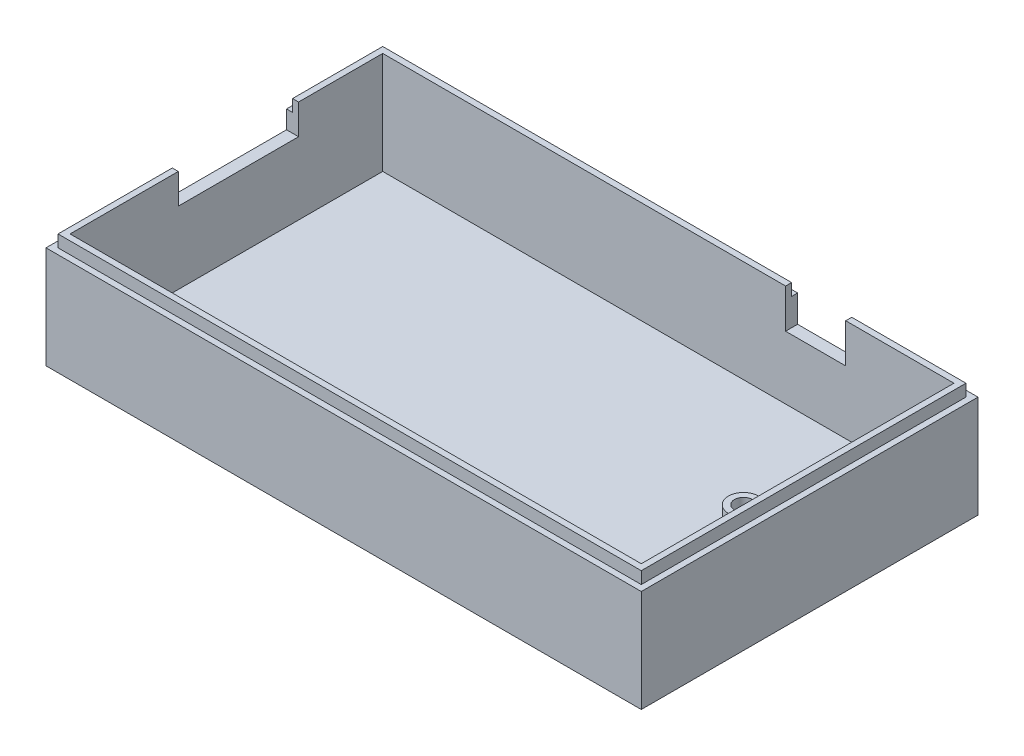
ISO-10303-21;
HEADER;
FILE_DESCRIPTION(('STEP AP214'),'2;1');
FILE_NAME('part.step','',(''),(''),'','','');
FILE_SCHEMA(('AUTOMOTIVE_DESIGN { 1 0 10303 214 1 1 1 1 }'));
ENDSEC;
DATA;
#1=APPLICATION_CONTEXT('core data for automotive mechanical design processes');
#2=APPLICATION_PROTOCOL_DEFINITION('international standard','automotive_design',2000,#1);
#3=PRODUCT_CONTEXT('',#1,'mechanical');
#4=PRODUCT('Part','Part','',(#3));
#5=PRODUCT_RELATED_PRODUCT_CATEGORY('part','',(#4));
#6=PRODUCT_DEFINITION_FORMATION('','',#4);
#7=PRODUCT_DEFINITION_CONTEXT('part definition',#1,'design');
#8=PRODUCT_DEFINITION('design','',#6,#7);
#9=PRODUCT_DEFINITION_SHAPE('','',#8);
#10=(LENGTH_UNIT() NAMED_UNIT(*) SI_UNIT(.MILLI.,.METRE.));
#11=(NAMED_UNIT(*) PLANE_ANGLE_UNIT() SI_UNIT($,.RADIAN.));
#12=(NAMED_UNIT(*) SI_UNIT($,.STERADIAN.) SOLID_ANGLE_UNIT());
#13=UNCERTAINTY_MEASURE_WITH_UNIT(LENGTH_MEASURE(1.E-05),#10,'distance_accuracy_value','');
#14=(GEOMETRIC_REPRESENTATION_CONTEXT(3) GLOBAL_UNCERTAINTY_ASSIGNED_CONTEXT((#13)) GLOBAL_UNIT_ASSIGNED_CONTEXT((#10,
#11,#12)) REPRESENTATION_CONTEXT('',''));
#15=CARTESIAN_POINT('',(0.,0.,0.));
#16=DIRECTION('',(0.,0.,1.));
#17=DIRECTION('',(1.,0.,0.));
#18=AXIS2_PLACEMENT_3D('',#15,#16,#17);
#19=CARTESIAN_POINT('',(0.,15.,0.));
#20=DIRECTION('',(0.,1.,0.));
#21=DIRECTION('',(0.,0.,1.));
#22=AXIS2_PLACEMENT_3D('',#19,#20,#21);
#23=PLANE('',#22);
#24=DIRECTION('',(0.,0.,-1.));
#25=VECTOR('',#24,1.);
#26=CARTESIAN_POINT('',(19.5,15.,28.001));
#27=LINE('',#26,#25);
#28=CARTESIAN_POINT('',(19.5,15.,-27.));
#29=VERTEX_POINT('',#28);
#30=CARTESIAN_POINT('',(19.5,15.,-28.));
#31=VERTEX_POINT('',#30);
#32=EDGE_CURVE('E229',#29,#31,#27,.T.);
#33=ORIENTED_EDGE('',*,*,#32,.T.);
#34=DIRECTION('',(1.,0.,0.));
#35=VECTOR('',#34,1.);
#36=CARTESIAN_POINT('',(0.,15.,-28.));
#37=LINE('',#36,#35);
#38=CARTESIAN_POINT('',(-49.5,15.,-28.));
#39=VERTEX_POINT('',#38);
#40=EDGE_CURVE('E324',#39,#31,#37,.T.);
#41=ORIENTED_EDGE('',*,*,#40,.F.);
#42=DIRECTION('',(0.,0.,1.));
#43=VECTOR('',#42,1.);
#44=CARTESIAN_POINT('',(-49.5,15.,0.));
#45=LINE('',#44,#43);
#46=CARTESIAN_POINT('',(-49.5,15.,-12.));
#47=VERTEX_POINT('',#46);
#48=EDGE_CURVE('E319',#39,#47,#45,.T.);
#49=ORIENTED_EDGE('',*,*,#48,.T.);
#50=DIRECTION('',(1.,0.,0.));
#51=VECTOR('',#50,1.);
#52=CARTESIAN_POINT('',(49.501,15.,-12.));
#53=LINE('',#52,#51);
#54=CARTESIAN_POINT('',(-48.5,15.,-12.));
#55=VERTEX_POINT('',#54);
#56=EDGE_CURVE('E439',#47,#55,#53,.T.);
#57=ORIENTED_EDGE('',*,*,#56,.T.);
#58=DIRECTION('',(0.,0.,-1.));
#59=VECTOR('',#58,1.);
#60=CARTESIAN_POINT('',(-48.5,15.,0.));
#61=LINE('',#60,#59);
#62=CARTESIAN_POINT('',(-48.5,15.,-27.));
#63=VERTEX_POINT('',#62);
#64=EDGE_CURVE('E243',#55,#63,#61,.T.);
#65=ORIENTED_EDGE('',*,*,#64,.T.);
#66=DIRECTION('',(-1.,0.,0.));
#67=VECTOR('',#66,1.);
#68=CARTESIAN_POINT('',(0.,15.,-27.));
#69=LINE('',#68,#67);
#70=EDGE_CURVE('E236',#29,#63,#69,.T.);
#71=ORIENTED_EDGE('',*,*,#70,.F.);
#72=EDGE_LOOP('',(#33,#41,#49,#57,#65,#71));
#73=FACE_BOUND('',#72,.T.);
#74=ADVANCED_FACE('F48',(#73),#23,.T.);
#75=CARTESIAN_POINT('',(0.,17.,-27.));
#76=DIRECTION('',(0.,0.,-1.));
#77=DIRECTION('',(-1.,0.,0.));
#78=AXIS2_PLACEMENT_3D('',#75,#76,#77);
#79=PLANE('',#78);
#80=DIRECTION('',(0.,-1.,0.));
#81=VECTOR('',#80,1.);
#82=CARTESIAN_POINT('',(19.5,17.,-27.));
#83=LINE('',#82,#81);
#84=CARTESIAN_POINT('',(19.5,17.,-27.));
#85=VERTEX_POINT('',#84);
#86=EDGE_CURVE('E443',#85,#29,#83,.T.);
#87=ORIENTED_EDGE('',*,*,#86,.T.);
#88=ORIENTED_EDGE('',*,*,#70,.T.);
#89=DIRECTION('',(0.,-1.,0.));
#90=VECTOR('',#89,1.);
#91=CARTESIAN_POINT('',(-48.5,17.,-27.));
#92=LINE('',#91,#90);
#93=CARTESIAN_POINT('',(-48.5,17.,-27.));
#94=VERTEX_POINT('',#93);
#95=EDGE_CURVE('E333',#94,#63,#92,.T.);
#96=ORIENTED_EDGE('',*,*,#95,.F.);
#97=DIRECTION('',(1.,0.,0.));
#98=VECTOR('',#97,1.);
#99=CARTESIAN_POINT('',(0.,17.,-27.));
#100=LINE('',#99,#98);
#101=EDGE_CURVE('E370',#94,#85,#100,.T.);
#102=ORIENTED_EDGE('',*,*,#101,.T.);
#103=EDGE_LOOP('',(#87,#88,#96,#102));
#104=FACE_BOUND('',#103,.T.);
#105=ADVANCED_FACE('F532',(#104),#79,.T.);
#106=CARTESIAN_POINT('',(0.,17.,0.));
#107=DIRECTION('',(0.,1.,0.));
#108=DIRECTION('',(0.,0.,1.));
#109=AXIS2_PLACEMENT_3D('',#106,#107,#108);
#110=PLANE('',#109);
#111=DIRECTION('',(0.,0.,-1.));
#112=VECTOR('',#111,1.);
#113=CARTESIAN_POINT('',(19.5,17.,28.001));
#114=LINE('',#113,#112);
#115=CARTESIAN_POINT('',(19.5,17.,-26.));
#116=VERTEX_POINT('',#115);
#117=EDGE_CURVE('E458',#116,#85,#114,.T.);
#118=ORIENTED_EDGE('',*,*,#117,.T.);
#119=ORIENTED_EDGE('',*,*,#101,.F.);
#120=DIRECTION('',(0.,0.,1.));
#121=VECTOR('',#120,1.);
#122=CARTESIAN_POINT('',(-48.5,17.,0.));
#123=LINE('',#122,#121);
#124=CARTESIAN_POINT('',(-48.5,17.,-12.));
#125=VERTEX_POINT('',#124);
#126=EDGE_CURVE('E365',#94,#125,#123,.T.);
#127=ORIENTED_EDGE('',*,*,#126,.T.);
#128=DIRECTION('',(-1.,0.,0.));
#129=VECTOR('',#128,1.);
#130=CARTESIAN_POINT('',(49.501,17.,-12.));
#131=LINE('',#130,#129);
#132=CARTESIAN_POINT('',(-47.5,17.,-12.));
#133=VERTEX_POINT('',#132);
#134=EDGE_CURVE('E399',#133,#125,#131,.T.);
#135=ORIENTED_EDGE('',*,*,#134,.F.);
#136=DIRECTION('',(0.,0.,1.));
#137=VECTOR('',#136,1.);
#138=CARTESIAN_POINT('',(-47.5,17.,0.));
#139=LINE('',#138,#137);
#140=CARTESIAN_POINT('',(-47.5,17.,-26.));
#141=VERTEX_POINT('',#140);
#142=EDGE_CURVE('E344',#141,#133,#139,.T.);
#143=ORIENTED_EDGE('',*,*,#142,.F.);
#144=DIRECTION('',(1.,0.,0.));
#145=VECTOR('',#144,1.);
#146=CARTESIAN_POINT('',(0.,17.,-26.));
#147=LINE('',#146,#145);
#148=EDGE_CURVE('E357',#141,#116,#147,.T.);
#149=ORIENTED_EDGE('',*,*,#148,.T.);
#150=EDGE_LOOP('',(#118,#119,#127,#135,#143,#149));
#151=FACE_BOUND('',#150,.T.);
#152=ADVANCED_FACE('F535',(#151),#110,.T.);
#153=CARTESIAN_POINT('',(-48.5,17.,0.));
#154=DIRECTION('',(1.,0.,0.));
#155=DIRECTION('',(0.,0.,-1.));
#156=AXIS2_PLACEMENT_3D('',#153,#154,#155);
#157=PLANE('',#156);
#158=ORIENTED_EDGE('',*,*,#64,.F.);
#159=DIRECTION('',(0.,-1.,0.));
#160=VECTOR('',#159,1.);
#161=CARTESIAN_POINT('',(-48.5,17.,-12.));
#162=LINE('',#161,#160);
#163=EDGE_CURVE('E432',#125,#55,#162,.T.);
#164=ORIENTED_EDGE('',*,*,#163,.F.);
#165=ORIENTED_EDGE('',*,*,#126,.F.);
#166=ORIENTED_EDGE('',*,*,#95,.T.);
#167=EDGE_LOOP('',(#158,#164,#165,#166));
#168=FACE_BOUND('',#167,.T.);
#169=ADVANCED_FACE('F500',(#168),#157,.F.);
#170=CARTESIAN_POINT('',(0.,0.,0.));
#171=DIRECTION('',(0.,1.,0.));
#172=DIRECTION('',(0.,0.,1.));
#173=AXIS2_PLACEMENT_3D('',#170,#171,#172);
#174=PLANE('',#173);
#175=CARTESIAN_POINT('',(-44.5,0.,21.));
#176=DIRECTION('',(0.,1.,0.));
#177=DIRECTION('',(0.,0.,1.));
#178=AXIS2_PLACEMENT_3D('',#175,#176,#177);
#179=CIRCLE('',#178,1.49999999999999);
#180=CARTESIAN_POINT('',(-44.5,0.,22.5));
#181=VERTEX_POINT('',#180);
#182=EDGE_CURVE('E391',#181,#181,#179,.T.);
#183=ORIENTED_EDGE('',*,*,#182,.F.);
#184=EDGE_LOOP('',(#183));
#185=FACE_BOUND('',#184,.T.);
#186=CARTESIAN_POINT('',(44.5,0.,-21.));
#187=DIRECTION('',(0.,1.,0.));
#188=DIRECTION('',(0.,0.,1.));
#189=AXIS2_PLACEMENT_3D('',#186,#187,#188);
#190=CIRCLE('',#189,1.49999999999999);
#191=CARTESIAN_POINT('',(44.5,0.,-19.5));
#192=VERTEX_POINT('',#191);
#193=EDGE_CURVE('E383',#192,#192,#190,.T.);
#194=ORIENTED_EDGE('',*,*,#193,.F.);
#195=EDGE_LOOP('',(#194));
#196=FACE_BOUND('',#195,.T.);
#197=CARTESIAN_POINT('',(38.5,0.,0.));
#198=DIRECTION('',(0.,1.,0.));
#199=DIRECTION('',(0.,0.,1.));
#200=AXIS2_PLACEMENT_3D('',#197,#198,#199);
#201=CIRCLE('',#200,2.5);
#202=CARTESIAN_POINT('',(38.5,0.,2.5));
#203=VERTEX_POINT('',#202);
#204=EDGE_CURVE('E263',#203,#203,#201,.T.);
#205=ORIENTED_EDGE('',*,*,#204,.F.);
#206=EDGE_LOOP('',(#205));
#207=FACE_BOUND('',#206,.T.);
#208=DIRECTION('',(0.,0.,1.));
#209=VECTOR('',#208,1.);
#210=CARTESIAN_POINT('',(47.5,0.,0.));
#211=LINE('',#210,#209);
#212=CARTESIAN_POINT('',(47.5,0.,-26.));
#213=VERTEX_POINT('',#212);
#214=CARTESIAN_POINT('',(47.5,0.,26.));
#215=VERTEX_POINT('',#214);
#216=EDGE_CURVE('E308',#213,#215,#211,.T.);
#217=ORIENTED_EDGE('',*,*,#216,.F.);
#218=DIRECTION('',(1.,0.,0.));
#219=VECTOR('',#218,1.);
#220=CARTESIAN_POINT('',(0.,0.,-26.));
#221=LINE('',#220,#219);
#222=CARTESIAN_POINT('',(-47.5,0.,-26.));
#223=VERTEX_POINT('',#222);
#224=EDGE_CURVE('E312',#223,#213,#221,.T.);
#225=ORIENTED_EDGE('',*,*,#224,.F.);
#226=DIRECTION('',(0.,0.,1.));
#227=VECTOR('',#226,1.);
#228=CARTESIAN_POINT('',(-47.5,0.,0.));
#229=LINE('',#228,#227);
#230=CARTESIAN_POINT('',(-47.5,0.,26.));
#231=VERTEX_POINT('',#230);
#232=EDGE_CURVE('E301',#223,#231,#229,.T.);
#233=ORIENTED_EDGE('',*,*,#232,.T.);
#234=DIRECTION('',(1.,0.,0.));
#235=VECTOR('',#234,1.);
#236=CARTESIAN_POINT('',(0.,0.,26.));
#237=LINE('',#236,#235);
#238=EDGE_CURVE('E305',#231,#215,#237,.T.);
#239=ORIENTED_EDGE('',*,*,#238,.T.);
#240=EDGE_LOOP('',(#217,#225,#233,#239));
#241=FACE_BOUND('',#240,.T.);
#242=ADVANCED_FACE('F534',(#185,#196,#207,#241),#174,.T.);
#243=CARTESIAN_POINT('',(49.5,-2.,0.));
#244=DIRECTION('',(-1.,0.,0.));
#245=DIRECTION('',(0.,0.,1.));
#246=AXIS2_PLACEMENT_3D('',#243,#244,#245);
#247=PLANE('',#246);
#248=DIRECTION('',(0.,1.,0.));
#249=VECTOR('',#248,1.);
#250=CARTESIAN_POINT('',(49.5,-2.,-28.));
#251=LINE('',#250,#249);
#252=CARTESIAN_POINT('',(49.5,-2.,-28.));
#253=VERTEX_POINT('',#252);
#254=CARTESIAN_POINT('',(49.5,15.,-28.));
#255=VERTEX_POINT('',#254);
#256=EDGE_CURVE('E249',#253,#255,#251,.T.);
#257=ORIENTED_EDGE('',*,*,#256,.T.);
#258=DIRECTION('',(0.,0.,1.));
#259=VECTOR('',#258,1.);
#260=CARTESIAN_POINT('',(49.5,15.,0.));
#261=LINE('',#260,#259);
#262=CARTESIAN_POINT('',(49.5,15.,28.));
#263=VERTEX_POINT('',#262);
#264=EDGE_CURVE('E304',#255,#263,#261,.T.);
#265=ORIENTED_EDGE('',*,*,#264,.T.);
#266=DIRECTION('',(0.,1.,0.));
#267=VECTOR('',#266,1.);
#268=CARTESIAN_POINT('',(49.5,-2.,28.));
#269=LINE('',#268,#267);
#270=CARTESIAN_POINT('',(49.5,-2.,28.));
#271=VERTEX_POINT('',#270);
#272=EDGE_CURVE('E248',#271,#263,#269,.T.);
#273=ORIENTED_EDGE('',*,*,#272,.F.);
#274=DIRECTION('',(0.,0.,1.));
#275=VECTOR('',#274,1.);
#276=CARTESIAN_POINT('',(49.5,-2.,0.));
#277=LINE('',#276,#275);
#278=EDGE_CURVE('E279',#253,#271,#277,.T.);
#279=ORIENTED_EDGE('',*,*,#278,.F.);
#280=EDGE_LOOP('',(#257,#265,#273,#279));
#281=FACE_BOUND('',#280,.T.);
#282=ADVANCED_FACE('F572',(#281),#247,.F.);
#283=CARTESIAN_POINT('',(0.,-2.,28.));
#284=DIRECTION('',(0.,0.,1.));
#285=DIRECTION('',(1.,0.,0.));
#286=AXIS2_PLACEMENT_3D('',#283,#284,#285);
#287=PLANE('',#286);
#288=ORIENTED_EDGE('',*,*,#272,.T.);
#289=DIRECTION('',(1.,0.,0.));
#290=VECTOR('',#289,1.);
#291=CARTESIAN_POINT('',(0.,15.,28.));
#292=LINE('',#291,#290);
#293=CARTESIAN_POINT('',(-49.5,15.,28.));
#294=VERTEX_POINT('',#293);
#295=EDGE_CURVE('E300',#294,#263,#292,.T.);
#296=ORIENTED_EDGE('',*,*,#295,.F.);
#297=DIRECTION('',(0.,1.,0.));
#298=VECTOR('',#297,1.);
#299=CARTESIAN_POINT('',(-49.5,-2.,28.));
#300=LINE('',#299,#298);
#301=CARTESIAN_POINT('',(-49.5,-2.,28.));
#302=VERTEX_POINT('',#301);
#303=EDGE_CURVE('E257',#302,#294,#300,.T.);
#304=ORIENTED_EDGE('',*,*,#303,.F.);
#305=DIRECTION('',(1.,0.,0.));
#306=VECTOR('',#305,1.);
#307=CARTESIAN_POINT('',(0.,-2.,28.));
#308=LINE('',#307,#306);
#309=EDGE_CURVE('E254',#302,#271,#308,.T.);
#310=ORIENTED_EDGE('',*,*,#309,.T.);
#311=EDGE_LOOP('',(#288,#296,#304,#310));
#312=FACE_BOUND('',#311,.T.);
#313=ADVANCED_FACE('F574',(#312),#287,.T.);
#314=CARTESIAN_POINT('',(-49.5,-2.,0.));
#315=DIRECTION('',(-1.,0.,0.));
#316=DIRECTION('',(0.,0.,1.));
#317=AXIS2_PLACEMENT_3D('',#314,#315,#316);
#318=PLANE('',#317);
#319=DIRECTION('',(0.,-1.,0.));
#320=VECTOR('',#319,1.);
#321=CARTESIAN_POINT('',(-49.5,17.,-12.));
#322=LINE('',#321,#320);
#323=CARTESIAN_POINT('',(-49.5,12.,-12.));
#324=VERTEX_POINT('',#323);
#325=EDGE_CURVE('E411',#47,#324,#322,.T.);
#326=ORIENTED_EDGE('',*,*,#325,.F.);
#327=ORIENTED_EDGE('',*,*,#48,.F.);
#328=DIRECTION('',(0.,1.,0.));
#329=VECTOR('',#328,1.);
#330=CARTESIAN_POINT('',(-49.5,-2.,-28.));
#331=LINE('',#330,#329);
#332=CARTESIAN_POINT('',(-49.5,-2.,-28.));
#333=VERTEX_POINT('',#332);
#334=EDGE_CURVE('E253',#333,#39,#331,.T.);
#335=ORIENTED_EDGE('',*,*,#334,.F.);
#336=DIRECTION('',(0.,0.,1.));
#337=VECTOR('',#336,1.);
#338=CARTESIAN_POINT('',(-49.5,-2.,0.));
#339=LINE('',#338,#337);
#340=EDGE_CURVE('E272',#333,#302,#339,.T.);
#341=ORIENTED_EDGE('',*,*,#340,.T.);
#342=ORIENTED_EDGE('',*,*,#303,.T.);
#343=CARTESIAN_POINT('',(-49.5,15.,8.00000000000002));
#344=VERTEX_POINT('',#343);
#345=EDGE_CURVE('E323',#344,#294,#45,.T.);
#346=ORIENTED_EDGE('',*,*,#345,.F.);
#347=DIRECTION('',(0.,1.,0.));
#348=VECTOR('',#347,1.);
#349=CARTESIAN_POINT('',(-49.5,17.,8.00000000000001));
#350=LINE('',#349,#348);
#351=CARTESIAN_POINT('',(-49.5,12.,8.00000000000002));
#352=VERTEX_POINT('',#351);
#353=EDGE_CURVE('E415',#352,#344,#350,.T.);
#354=ORIENTED_EDGE('',*,*,#353,.F.);
#355=DIRECTION('',(0.,0.,1.));
#356=VECTOR('',#355,1.);
#357=CARTESIAN_POINT('',(-49.5,12.,8.00000000000002));
#358=LINE('',#357,#356);
#359=EDGE_CURVE('E400',#324,#352,#358,.T.);
#360=ORIENTED_EDGE('',*,*,#359,.F.);
#361=EDGE_LOOP('',(#326,#327,#335,#341,#342,#346,#354,#360));
#362=FACE_BOUND('',#361,.T.);
#363=ADVANCED_FACE('F494',(#362),#318,.T.);
#364=CARTESIAN_POINT('',(38.5,-2.,0.));
#365=DIRECTION('',(0.,1.,0.));
#366=DIRECTION('',(0.,0.,1.));
#367=AXIS2_PLACEMENT_3D('',#364,#365,#366);
#368=CYLINDRICAL_SURFACE('',#367,2.5);
#369=CARTESIAN_POINT('',(38.5,-2.,0.));
#370=DIRECTION('',(0.,1.,0.));
#371=DIRECTION('',(0.,0.,1.));
#372=AXIS2_PLACEMENT_3D('',#369,#370,#371);
#373=CIRCLE('',#372,2.5);
#374=CARTESIAN_POINT('',(38.5,-2.,2.5));
#375=VERTEX_POINT('',#374);
#376=EDGE_CURVE('E267',#375,#375,#373,.T.);
#377=ORIENTED_EDGE('',*,*,#376,.F.);
#378=EDGE_LOOP('',(#377));
#379=FACE_BOUND('',#378,.T.);
#380=ORIENTED_EDGE('',*,*,#204,.T.);
#381=EDGE_LOOP('',(#380));
#382=FACE_BOUND('',#381,.T.);
#383=ADVANCED_FACE('F50',(#379,#382),#368,.F.);
#384=CARTESIAN_POINT('',(0.,-2.,-28.));
#385=DIRECTION('',(0.,0.,1.));
#386=DIRECTION('',(1.,0.,0.));
#387=AXIS2_PLACEMENT_3D('',#384,#385,#386);
#388=PLANE('',#387);
#389=ORIENTED_EDGE('',*,*,#40,.T.);
#390=DIRECTION('',(0.,1.,0.));
#391=VECTOR('',#390,1.);
#392=CARTESIAN_POINT('',(19.5,17.,-28.));
#393=LINE('',#392,#391);
#394=CARTESIAN_POINT('',(19.5,10.4886705199972,-28.));
#395=VERTEX_POINT('',#394);
#396=EDGE_CURVE('E455',#395,#31,#393,.T.);
#397=ORIENTED_EDGE('',*,*,#396,.F.);
#398=DIRECTION('',(-1.,0.,0.));
#399=VECTOR('',#398,1.);
#400=CARTESIAN_POINT('',(29.5,10.4886705199972,-28.));
#401=LINE('',#400,#399);
#402=CARTESIAN_POINT('',(29.5,10.4886705199972,-28.));
#403=VERTEX_POINT('',#402);
#404=EDGE_CURVE('E466',#403,#395,#401,.T.);
#405=ORIENTED_EDGE('',*,*,#404,.F.);
#406=DIRECTION('',(0.,-1.,0.));
#407=VECTOR('',#406,1.);
#408=CARTESIAN_POINT('',(29.5,17.,-28.));
#409=LINE('',#408,#407);
#410=CARTESIAN_POINT('',(29.5,15.,-28.));
#411=VERTEX_POINT('',#410);
#412=EDGE_CURVE('E218',#411,#403,#409,.T.);
#413=ORIENTED_EDGE('',*,*,#412,.F.);
#414=EDGE_CURVE('E226',#411,#255,#37,.T.);
#415=ORIENTED_EDGE('',*,*,#414,.T.);
#416=ORIENTED_EDGE('',*,*,#256,.F.);
#417=DIRECTION('',(1.,0.,0.));
#418=VECTOR('',#417,1.);
#419=CARTESIAN_POINT('',(0.,-2.,-28.));
#420=LINE('',#419,#418);
#421=EDGE_CURVE('E276',#333,#253,#420,.T.);
#422=ORIENTED_EDGE('',*,*,#421,.F.);
#423=ORIENTED_EDGE('',*,*,#334,.T.);
#424=EDGE_LOOP('',(#389,#397,#405,#413,#415,#416,#422,#423));
#425=FACE_BOUND('',#424,.T.);
#426=ADVANCED_FACE('F486',(#425),#388,.F.);
#427=CARTESIAN_POINT('',(0.,-2.,0.));
#428=DIRECTION('',(0.,1.,0.));
#429=DIRECTION('',(0.,0.,1.));
#430=AXIS2_PLACEMENT_3D('',#427,#428,#429);
#431=PLANE('',#430);
#432=CARTESIAN_POINT('',(-44.5,-2.,21.));
#433=DIRECTION('',(0.,1.,0.));
#434=DIRECTION('',(0.,0.,1.));
#435=AXIS2_PLACEMENT_3D('',#432,#433,#434);
#436=CIRCLE('',#435,1.49999999999999);
#437=CARTESIAN_POINT('',(-44.5,-2.,22.5));
#438=VERTEX_POINT('',#437);
#439=EDGE_CURVE('E387',#438,#438,#436,.T.);
#440=ORIENTED_EDGE('',*,*,#439,.T.);
#441=EDGE_LOOP('',(#440));
#442=FACE_BOUND('',#441,.T.);
#443=CARTESIAN_POINT('',(44.5,-2.,-21.));
#444=DIRECTION('',(0.,1.,0.));
#445=DIRECTION('',(0.,0.,1.));
#446=AXIS2_PLACEMENT_3D('',#443,#444,#445);
#447=CIRCLE('',#446,1.49999999999999);
#448=CARTESIAN_POINT('',(44.5,-2.,-19.5));
#449=VERTEX_POINT('',#448);
#450=EDGE_CURVE('E379',#449,#449,#447,.T.);
#451=ORIENTED_EDGE('',*,*,#450,.T.);
#452=EDGE_LOOP('',(#451));
#453=FACE_BOUND('',#452,.T.);
#454=ORIENTED_EDGE('',*,*,#376,.T.);
#455=EDGE_LOOP('',(#454));
#456=FACE_BOUND('',#455,.T.);
#457=ORIENTED_EDGE('',*,*,#278,.T.);
#458=ORIENTED_EDGE('',*,*,#309,.F.);
#459=ORIENTED_EDGE('',*,*,#340,.F.);
#460=ORIENTED_EDGE('',*,*,#421,.T.);
#461=EDGE_LOOP('',(#457,#458,#459,#460));
#462=FACE_BOUND('',#461,.T.);
#463=ADVANCED_FACE('F565',(#442,#453,#456,#462),#431,.F.);
#464=CARTESIAN_POINT('',(0.,15.,-26.));
#465=DIRECTION('',(0.,0.,-1.));
#466=DIRECTION('',(-1.,0.,0.));
#467=AXIS2_PLACEMENT_3D('',#464,#465,#466);
#468=PLANE('',#467);
#469=DIRECTION('',(1.,0.,0.));
#470=VECTOR('',#469,1.);
#471=CARTESIAN_POINT('',(29.5,10.4886705199972,-26.));
#472=LINE('',#471,#470);
#473=CARTESIAN_POINT('',(19.5,10.4886705199972,-26.));
#474=VERTEX_POINT('',#473);
#475=CARTESIAN_POINT('',(29.5,10.4886705199972,-26.));
#476=VERTEX_POINT('',#475);
#477=EDGE_CURVE('E447',#474,#476,#472,.T.);
#478=ORIENTED_EDGE('',*,*,#477,.F.);
#479=DIRECTION('',(0.,-1.,0.));
#480=VECTOR('',#479,1.);
#481=CARTESIAN_POINT('',(19.5,17.,-26.));
#482=LINE('',#481,#480);
#483=EDGE_CURVE('E228',#116,#474,#482,.T.);
#484=ORIENTED_EDGE('',*,*,#483,.F.);
#485=ORIENTED_EDGE('',*,*,#148,.F.);
#486=DIRECTION('',(0.,-1.,0.));
#487=VECTOR('',#486,1.);
#488=CARTESIAN_POINT('',(-47.5,15.,-26.));
#489=LINE('',#488,#487);
#490=EDGE_CURVE('E296',#141,#223,#489,.T.);
#491=ORIENTED_EDGE('',*,*,#490,.T.);
#492=ORIENTED_EDGE('',*,*,#224,.T.);
#493=DIRECTION('',(0.,-1.,0.));
#494=VECTOR('',#493,1.);
#495=CARTESIAN_POINT('',(47.5,15.,-26.));
#496=LINE('',#495,#494);
#497=CARTESIAN_POINT('',(47.5,17.,-26.));
#498=VERTEX_POINT('',#497);
#499=EDGE_CURVE('E268',#498,#213,#496,.T.);
#500=ORIENTED_EDGE('',*,*,#499,.F.);
#501=CARTESIAN_POINT('',(29.5,17.,-26.));
#502=VERTEX_POINT('',#501);
#503=EDGE_CURVE('E361',#502,#498,#147,.T.);
#504=ORIENTED_EDGE('',*,*,#503,.F.);
#505=DIRECTION('',(0.,1.,0.));
#506=VECTOR('',#505,1.);
#507=CARTESIAN_POINT('',(29.5,17.,-26.));
#508=LINE('',#507,#506);
#509=EDGE_CURVE('E64',#476,#502,#508,.T.);
#510=ORIENTED_EDGE('',*,*,#509,.F.);
#511=EDGE_LOOP('',(#478,#484,#485,#491,#492,#500,#504,#510));
#512=FACE_BOUND('',#511,.T.);
#513=ADVANCED_FACE('F561',(#512),#468,.F.);
#514=CARTESIAN_POINT('',(47.5,15.,0.));
#515=DIRECTION('',(1.,0.,0.));
#516=DIRECTION('',(0.,0.,-1.));
#517=AXIS2_PLACEMENT_3D('',#514,#515,#516);
#518=PLANE('',#517);
#519=ORIENTED_EDGE('',*,*,#216,.T.);
#520=DIRECTION('',(0.,-1.,0.));
#521=VECTOR('',#520,1.);
#522=CARTESIAN_POINT('',(47.5,15.,26.));
#523=LINE('',#522,#521);
#524=CARTESIAN_POINT('',(47.5,17.,26.));
#525=VERTEX_POINT('',#524);
#526=EDGE_CURVE('E288',#525,#215,#523,.T.);
#527=ORIENTED_EDGE('',*,*,#526,.F.);
#528=DIRECTION('',(0.,0.,1.));
#529=VECTOR('',#528,1.);
#530=CARTESIAN_POINT('',(47.5,17.,0.));
#531=LINE('',#530,#529);
#532=EDGE_CURVE('E353',#498,#525,#531,.T.);
#533=ORIENTED_EDGE('',*,*,#532,.F.);
#534=ORIENTED_EDGE('',*,*,#499,.T.);
#535=EDGE_LOOP('',(#519,#527,#533,#534));
#536=FACE_BOUND('',#535,.T.);
#537=ADVANCED_FACE('F555',(#536),#518,.F.);
#538=CARTESIAN_POINT('',(0.,15.,26.));
#539=DIRECTION('',(0.,0.,-1.));
#540=DIRECTION('',(-1.,0.,0.));
#541=AXIS2_PLACEMENT_3D('',#538,#539,#540);
#542=PLANE('',#541);
#543=ORIENTED_EDGE('',*,*,#238,.F.);
#544=DIRECTION('',(0.,-1.,0.));
#545=VECTOR('',#544,1.);
#546=CARTESIAN_POINT('',(-47.5,15.,26.));
#547=LINE('',#546,#545);
#548=CARTESIAN_POINT('',(-47.5,17.,26.));
#549=VERTEX_POINT('',#548);
#550=EDGE_CURVE('E292',#549,#231,#547,.T.);
#551=ORIENTED_EDGE('',*,*,#550,.F.);
#552=DIRECTION('',(1.,0.,0.));
#553=VECTOR('',#552,1.);
#554=CARTESIAN_POINT('',(0.,17.,26.));
#555=LINE('',#554,#553);
#556=EDGE_CURVE('E349',#549,#525,#555,.T.);
#557=ORIENTED_EDGE('',*,*,#556,.T.);
#558=ORIENTED_EDGE('',*,*,#526,.T.);
#559=EDGE_LOOP('',(#543,#551,#557,#558));
#560=FACE_BOUND('',#559,.T.);
#561=ADVANCED_FACE('F550',(#560),#542,.T.);
#562=CARTESIAN_POINT('',(-47.5,15.,0.));
#563=DIRECTION('',(1.,0.,0.));
#564=DIRECTION('',(0.,0.,-1.));
#565=AXIS2_PLACEMENT_3D('',#562,#563,#564);
#566=PLANE('',#565);
#567=DIRECTION('',(0.,-1.,0.));
#568=VECTOR('',#567,1.);
#569=CARTESIAN_POINT('',(-47.5,17.,-12.));
#570=LINE('',#569,#568);
#571=CARTESIAN_POINT('',(-47.5,12.,-12.));
#572=VERTEX_POINT('',#571);
#573=EDGE_CURVE('E426',#133,#572,#570,.T.);
#574=ORIENTED_EDGE('',*,*,#573,.T.);
#575=DIRECTION('',(0.,0.,1.));
#576=VECTOR('',#575,1.);
#577=CARTESIAN_POINT('',(-47.5,12.,8.00000000000002));
#578=LINE('',#577,#576);
#579=CARTESIAN_POINT('',(-47.5,12.,8.00000000000002));
#580=VERTEX_POINT('',#579);
#581=EDGE_CURVE('E422',#572,#580,#578,.T.);
#582=ORIENTED_EDGE('',*,*,#581,.T.);
#583=DIRECTION('',(0.,1.,0.));
#584=VECTOR('',#583,1.);
#585=CARTESIAN_POINT('',(-47.5,17.,8.00000000000001));
#586=LINE('',#585,#584);
#587=CARTESIAN_POINT('',(-47.5,17.,8.00000000000001));
#588=VERTEX_POINT('',#587);
#589=EDGE_CURVE('E418',#580,#588,#586,.T.);
#590=ORIENTED_EDGE('',*,*,#589,.T.);
#591=EDGE_CURVE('E348',#588,#549,#139,.T.);
#592=ORIENTED_EDGE('',*,*,#591,.T.);
#593=ORIENTED_EDGE('',*,*,#550,.T.);
#594=ORIENTED_EDGE('',*,*,#232,.F.);
#595=ORIENTED_EDGE('',*,*,#490,.F.);
#596=ORIENTED_EDGE('',*,*,#142,.T.);
#597=EDGE_LOOP('',(#574,#582,#590,#592,#593,#594,#595,#596));
#598=FACE_BOUND('',#597,.T.);
#599=ADVANCED_FACE('F545',(#598),#566,.T.);
#600=DIRECTION('',(0.,0.,1.));
#601=VECTOR('',#600,1.);
#602=CARTESIAN_POINT('',(29.5,15.,28.001));
#603=LINE('',#602,#601);
#604=CARTESIAN_POINT('',(29.5,15.,-27.));
#605=VERTEX_POINT('',#604);
#606=EDGE_CURVE('E211',#411,#605,#603,.T.);
#607=ORIENTED_EDGE('',*,*,#606,.T.);
#608=CARTESIAN_POINT('',(48.5,15.,-27.));
#609=VERTEX_POINT('',#608);
#610=EDGE_CURVE('E57',#609,#605,#69,.T.);
#611=ORIENTED_EDGE('',*,*,#610,.F.);
#612=DIRECTION('',(0.,0.,-1.));
#613=VECTOR('',#612,1.);
#614=CARTESIAN_POINT('',(48.5,15.,0.));
#615=LINE('',#614,#613);
#616=CARTESIAN_POINT('',(48.5,15.,27.));
#617=VERTEX_POINT('',#616);
#618=EDGE_CURVE('E12',#617,#609,#615,.T.);
#619=ORIENTED_EDGE('',*,*,#618,.F.);
#620=DIRECTION('',(-1.,0.,0.));
#621=VECTOR('',#620,1.);
#622=CARTESIAN_POINT('',(0.,15.,27.));
#623=LINE('',#622,#621);
#624=CARTESIAN_POINT('',(-48.5,15.,27.));
#625=VERTEX_POINT('',#624);
#626=EDGE_CURVE('E244',#617,#625,#623,.T.);
#627=ORIENTED_EDGE('',*,*,#626,.T.);
#628=CARTESIAN_POINT('',(-48.5,15.,8.00000000000002));
#629=VERTEX_POINT('',#628);
#630=EDGE_CURVE('E238',#625,#629,#61,.T.);
#631=ORIENTED_EDGE('',*,*,#630,.T.);
#632=DIRECTION('',(-1.,0.,0.));
#633=VECTOR('',#632,1.);
#634=CARTESIAN_POINT('',(49.501,15.,8.00000000000002));
#635=LINE('',#634,#633);
#636=EDGE_CURVE('E435',#629,#344,#635,.T.);
#637=ORIENTED_EDGE('',*,*,#636,.T.);
#638=ORIENTED_EDGE('',*,*,#345,.T.);
#639=ORIENTED_EDGE('',*,*,#295,.T.);
#640=ORIENTED_EDGE('',*,*,#264,.F.);
#641=ORIENTED_EDGE('',*,*,#414,.F.);
#642=EDGE_LOOP('',(#607,#611,#619,#627,#631,#637,#638,#639,#640,#641));
#643=FACE_BOUND('',#642,.T.);
#644=ADVANCED_FACE('F223',(#643),#23,.T.);
#645=CARTESIAN_POINT('',(48.5,17.,0.));
#646=DIRECTION('',(1.,0.,0.));
#647=DIRECTION('',(0.,0.,-1.));
#648=AXIS2_PLACEMENT_3D('',#645,#646,#647);
#649=PLANE('',#648);
#650=DIRECTION('',(0.,-1.,0.));
#651=VECTOR('',#650,1.);
#652=CARTESIAN_POINT('',(48.5,17.,27.));
#653=LINE('',#652,#651);
#654=CARTESIAN_POINT('',(48.5,17.,27.));
#655=VERTEX_POINT('',#654);
#656=EDGE_CURVE('E340',#655,#617,#653,.T.);
#657=ORIENTED_EDGE('',*,*,#656,.T.);
#658=ORIENTED_EDGE('',*,*,#618,.T.);
#659=DIRECTION('',(0.,-1.,0.));
#660=VECTOR('',#659,1.);
#661=CARTESIAN_POINT('',(48.5,17.,-27.));
#662=LINE('',#661,#660);
#663=CARTESIAN_POINT('',(48.5,17.,-27.));
#664=VERTEX_POINT('',#663);
#665=EDGE_CURVE('E234',#664,#609,#662,.T.);
#666=ORIENTED_EDGE('',*,*,#665,.F.);
#667=DIRECTION('',(0.,0.,1.));
#668=VECTOR('',#667,1.);
#669=CARTESIAN_POINT('',(48.5,17.,0.));
#670=LINE('',#669,#668);
#671=EDGE_CURVE('E375',#664,#655,#670,.T.);
#672=ORIENTED_EDGE('',*,*,#671,.T.);
#673=EDGE_LOOP('',(#657,#658,#666,#672));
#674=FACE_BOUND('',#673,.T.);
#675=ADVANCED_FACE('F512',(#674),#649,.T.);
#676=DIRECTION('',(0.,1.,0.));
#677=VECTOR('',#676,1.);
#678=CARTESIAN_POINT('',(29.5,17.,-27.));
#679=LINE('',#678,#677);
#680=CARTESIAN_POINT('',(29.5,17.,-27.));
#681=VERTEX_POINT('',#680);
#682=EDGE_CURVE('E207',#605,#681,#679,.T.);
#683=ORIENTED_EDGE('',*,*,#682,.T.);
#684=EDGE_CURVE('E374',#681,#664,#100,.T.);
#685=ORIENTED_EDGE('',*,*,#684,.T.);
#686=ORIENTED_EDGE('',*,*,#665,.T.);
#687=ORIENTED_EDGE('',*,*,#610,.T.);
#688=EDGE_LOOP('',(#683,#685,#686,#687));
#689=FACE_BOUND('',#688,.T.);
#690=ADVANCED_FACE('F232',(#689),#79,.T.);
#691=CARTESIAN_POINT('',(-48.5,17.,8.00000000000001));
#692=VERTEX_POINT('',#691);
#693=CARTESIAN_POINT('',(-48.5,17.,27.));
#694=VERTEX_POINT('',#693);
#695=EDGE_CURVE('E369',#692,#694,#123,.T.);
#696=ORIENTED_EDGE('',*,*,#695,.F.);
#697=DIRECTION('',(0.,1.,0.));
#698=VECTOR('',#697,1.);
#699=CARTESIAN_POINT('',(-48.5,17.,8.00000000000001));
#700=LINE('',#699,#698);
#701=EDGE_CURVE('E72',#629,#692,#700,.T.);
#702=ORIENTED_EDGE('',*,*,#701,.F.);
#703=ORIENTED_EDGE('',*,*,#630,.F.);
#704=DIRECTION('',(0.,-1.,0.));
#705=VECTOR('',#704,1.);
#706=CARTESIAN_POINT('',(-48.5,17.,27.));
#707=LINE('',#706,#705);
#708=EDGE_CURVE('E337',#694,#625,#707,.T.);
#709=ORIENTED_EDGE('',*,*,#708,.F.);
#710=EDGE_LOOP('',(#696,#702,#703,#709));
#711=FACE_BOUND('',#710,.T.);
#712=ADVANCED_FACE('F523',(#711),#157,.F.);
#713=CARTESIAN_POINT('',(0.,17.,27.));
#714=DIRECTION('',(0.,0.,-1.));
#715=DIRECTION('',(-1.,0.,0.));
#716=AXIS2_PLACEMENT_3D('',#713,#714,#715);
#717=PLANE('',#716);
#718=ORIENTED_EDGE('',*,*,#626,.F.);
#719=ORIENTED_EDGE('',*,*,#656,.F.);
#720=DIRECTION('',(1.,0.,0.));
#721=VECTOR('',#720,1.);
#722=CARTESIAN_POINT('',(0.,17.,27.));
#723=LINE('',#722,#721);
#724=EDGE_CURVE('E362',#694,#655,#723,.T.);
#725=ORIENTED_EDGE('',*,*,#724,.F.);
#726=ORIENTED_EDGE('',*,*,#708,.T.);
#727=EDGE_LOOP('',(#718,#719,#725,#726));
#728=FACE_BOUND('',#727,.T.);
#729=ADVANCED_FACE('F519',(#728),#717,.F.);
#730=DIRECTION('',(0.,0.,-1.));
#731=VECTOR('',#730,1.);
#732=CARTESIAN_POINT('',(29.5,17.,28.001));
#733=LINE('',#732,#731);
#734=EDGE_CURVE('E213',#502,#681,#733,.T.);
#735=ORIENTED_EDGE('',*,*,#734,.F.);
#736=ORIENTED_EDGE('',*,*,#503,.T.);
#737=ORIENTED_EDGE('',*,*,#532,.T.);
#738=ORIENTED_EDGE('',*,*,#556,.F.);
#739=ORIENTED_EDGE('',*,*,#591,.F.);
#740=DIRECTION('',(-1.,0.,0.));
#741=VECTOR('',#740,1.);
#742=CARTESIAN_POINT('',(49.501,17.,8.00000000000001));
#743=LINE('',#742,#741);
#744=EDGE_CURVE('E396',#588,#692,#743,.T.);
#745=ORIENTED_EDGE('',*,*,#744,.T.);
#746=ORIENTED_EDGE('',*,*,#695,.T.);
#747=ORIENTED_EDGE('',*,*,#724,.T.);
#748=ORIENTED_EDGE('',*,*,#671,.F.);
#749=ORIENTED_EDGE('',*,*,#684,.F.);
#750=EDGE_LOOP('',(#735,#736,#737,#738,#739,#745,#746,#747,#748,#749));
#751=FACE_BOUND('',#750,.T.);
#752=ADVANCED_FACE('F513',(#751),#110,.T.);
#753=CARTESIAN_POINT('',(44.5,0.,-21.));
#754=DIRECTION('',(0.,1.,0.));
#755=DIRECTION('',(0.,0.,1.));
#756=AXIS2_PLACEMENT_3D('',#753,#754,#755);
#757=CYLINDRICAL_SURFACE('',#756,1.49999999999999);
#758=ORIENTED_EDGE('',*,*,#450,.F.);
#759=EDGE_LOOP('',(#758));
#760=FACE_BOUND('',#759,.T.);
#761=ORIENTED_EDGE('',*,*,#193,.T.);
#762=EDGE_LOOP('',(#761));
#763=FACE_BOUND('',#762,.T.);
#764=ADVANCED_FACE('F606',(#760,#763),#757,.F.);
#765=CARTESIAN_POINT('',(-44.5,0.,21.));
#766=DIRECTION('',(0.,1.,0.));
#767=DIRECTION('',(0.,0.,1.));
#768=AXIS2_PLACEMENT_3D('',#765,#766,#767);
#769=CYLINDRICAL_SURFACE('',#768,1.49999999999999);
#770=ORIENTED_EDGE('',*,*,#439,.F.);
#771=EDGE_LOOP('',(#770));
#772=FACE_BOUND('',#771,.T.);
#773=ORIENTED_EDGE('',*,*,#182,.T.);
#774=EDGE_LOOP('',(#773));
#775=FACE_BOUND('',#774,.T.);
#776=ADVANCED_FACE('F599',(#772,#775),#769,.F.);
#777=CARTESIAN_POINT('',(49.501,17.,-12.));
#778=DIRECTION('',(0.,0.,-1.));
#779=DIRECTION('',(-1.,0.,0.));
#780=AXIS2_PLACEMENT_3D('',#777,#778,#779);
#781=PLANE('',#780);
#782=ORIENTED_EDGE('',*,*,#134,.T.);
#783=ORIENTED_EDGE('',*,*,#163,.T.);
#784=ORIENTED_EDGE('',*,*,#56,.F.);
#785=ORIENTED_EDGE('',*,*,#325,.T.);
#786=DIRECTION('',(-1.,0.,0.));
#787=VECTOR('',#786,1.);
#788=CARTESIAN_POINT('',(49.501,12.,-12.));
#789=LINE('',#788,#787);
#790=EDGE_CURVE('E403',#572,#324,#789,.T.);
#791=ORIENTED_EDGE('',*,*,#790,.F.);
#792=ORIENTED_EDGE('',*,*,#573,.F.);
#793=EDGE_LOOP('',(#782,#783,#784,#785,#791,#792));
#794=FACE_BOUND('',#793,.T.);
#795=ADVANCED_FACE('F596',(#794),#781,.F.);
#796=CARTESIAN_POINT('',(49.501,12.,8.00000000000002));
#797=DIRECTION('',(0.,-1.,0.));
#798=DIRECTION('',(0.,0.,-1.));
#799=AXIS2_PLACEMENT_3D('',#796,#797,#798);
#800=PLANE('',#799);
#801=ORIENTED_EDGE('',*,*,#790,.T.);
#802=ORIENTED_EDGE('',*,*,#359,.T.);
#803=DIRECTION('',(-1.,0.,0.));
#804=VECTOR('',#803,1.);
#805=CARTESIAN_POINT('',(49.501,12.,8.00000000000002));
#806=LINE('',#805,#804);
#807=EDGE_CURVE('E395',#580,#352,#806,.T.);
#808=ORIENTED_EDGE('',*,*,#807,.F.);
#809=ORIENTED_EDGE('',*,*,#581,.F.);
#810=EDGE_LOOP('',(#801,#802,#808,#809));
#811=FACE_BOUND('',#810,.T.);
#812=ADVANCED_FACE('F594',(#811),#800,.F.);
#813=CARTESIAN_POINT('',(49.501,17.,8.00000000000001));
#814=DIRECTION('',(0.,0.,1.));
#815=DIRECTION('',(0.,-1.,0.));
#816=AXIS2_PLACEMENT_3D('',#813,#814,#815);
#817=PLANE('',#816);
#818=ORIENTED_EDGE('',*,*,#807,.T.);
#819=ORIENTED_EDGE('',*,*,#353,.T.);
#820=ORIENTED_EDGE('',*,*,#636,.F.);
#821=ORIENTED_EDGE('',*,*,#701,.T.);
#822=ORIENTED_EDGE('',*,*,#744,.F.);
#823=ORIENTED_EDGE('',*,*,#589,.F.);
#824=EDGE_LOOP('',(#818,#819,#820,#821,#822,#823));
#825=FACE_BOUND('',#824,.T.);
#826=ADVANCED_FACE('F591',(#825),#817,.F.);
#827=CARTESIAN_POINT('',(29.5,10.4886705199972,28.001));
#828=DIRECTION('',(0.,-1.,0.));
#829=DIRECTION('',(1.,0.,0.));
#830=AXIS2_PLACEMENT_3D('',#827,#828,#829);
#831=PLANE('',#830);
#832=ORIENTED_EDGE('',*,*,#477,.T.);
#833=DIRECTION('',(0.,0.,-1.));
#834=VECTOR('',#833,1.);
#835=CARTESIAN_POINT('',(29.5,10.4886705199972,28.001));
#836=LINE('',#835,#834);
#837=EDGE_CURVE('E451',#476,#403,#836,.T.);
#838=ORIENTED_EDGE('',*,*,#837,.T.);
#839=ORIENTED_EDGE('',*,*,#404,.T.);
#840=DIRECTION('',(0.,0.,-1.));
#841=VECTOR('',#840,1.);
#842=CARTESIAN_POINT('',(19.5,10.4886705199972,28.001));
#843=LINE('',#842,#841);
#844=EDGE_CURVE('E454',#474,#395,#843,.T.);
#845=ORIENTED_EDGE('',*,*,#844,.F.);
#846=EDGE_LOOP('',(#832,#838,#839,#845));
#847=FACE_BOUND('',#846,.T.);
#848=ADVANCED_FACE('F612',(#847),#831,.F.);
#849=CARTESIAN_POINT('',(19.5,17.,28.001));
#850=DIRECTION('',(-1.,0.,0.));
#851=DIRECTION('',(0.,-1.,0.));
#852=AXIS2_PLACEMENT_3D('',#849,#850,#851);
#853=PLANE('',#852);
#854=ORIENTED_EDGE('',*,*,#483,.T.);
#855=ORIENTED_EDGE('',*,*,#844,.T.);
#856=ORIENTED_EDGE('',*,*,#396,.T.);
#857=ORIENTED_EDGE('',*,*,#32,.F.);
#858=ORIENTED_EDGE('',*,*,#86,.F.);
#859=ORIENTED_EDGE('',*,*,#117,.F.);
#860=EDGE_LOOP('',(#854,#855,#856,#857,#858,#859));
#861=FACE_BOUND('',#860,.T.);
#862=ADVANCED_FACE('F630',(#861),#853,.F.);
#863=CARTESIAN_POINT('',(29.5,17.,28.001));
#864=DIRECTION('',(1.,0.,0.));
#865=DIRECTION('',(0.,1.,0.));
#866=AXIS2_PLACEMENT_3D('',#863,#864,#865);
#867=PLANE('',#866);
#868=ORIENTED_EDGE('',*,*,#509,.T.);
#869=ORIENTED_EDGE('',*,*,#734,.T.);
#870=ORIENTED_EDGE('',*,*,#682,.F.);
#871=ORIENTED_EDGE('',*,*,#606,.F.);
#872=ORIENTED_EDGE('',*,*,#412,.T.);
#873=ORIENTED_EDGE('',*,*,#837,.F.);
#874=EDGE_LOOP('',(#868,#869,#870,#871,#872,#873));
#875=FACE_BOUND('',#874,.T.);
#876=ADVANCED_FACE('F209',(#875),#867,.F.);
#877=CLOSED_SHELL('',(#74,#105,#152,#169,#242,#282,#313,#363,#383,#426,#463,#513,#537,#561,#599,
#644,#675,#690,#712,#729,#752,#764,#776,#795,#812,#826,#848,#862,#876));
#878=MANIFOLD_SOLID_BREP('B2',#877);
#879=CARTESIAN_POINT('',(38.5,8.,0.));
#880=DIRECTION('',(0.,-1.,0.));
#881=DIRECTION('',(0.,0.,-1.));
#882=AXIS2_PLACEMENT_3D('',#879,#880,#881);
#883=CYLINDRICAL_SURFACE('',#882,2.5);
#884=CARTESIAN_POINT('',(38.5,8.,0.));
#885=DIRECTION('',(0.,1.,0.));
#886=DIRECTION('',(0.,0.,1.));
#887=AXIS2_PLACEMENT_3D('',#884,#885,#886);
#888=CIRCLE('',#887,2.5);
#889=CARTESIAN_POINT('',(38.5,8.,2.5));
#890=VERTEX_POINT('',#889);
#891=EDGE_CURVE('E47',#890,#890,#888,.T.);
#892=ORIENTED_EDGE('',*,*,#891,.F.);
#893=EDGE_LOOP('',(#892));
#894=FACE_BOUND('',#893,.T.);
#895=CARTESIAN_POINT('',(38.5,0.,0.));
#896=DIRECTION('',(0.,1.,0.));
#897=DIRECTION('',(0.,0.,1.));
#898=AXIS2_PLACEMENT_3D('',#895,#896,#897);
#899=CIRCLE('',#898,2.5);
#900=CARTESIAN_POINT('',(38.5,0.,2.5));
#901=VERTEX_POINT('',#900);
#902=EDGE_CURVE('E863',#901,#901,#899,.T.);
#903=ORIENTED_EDGE('',*,*,#902,.T.);
#904=EDGE_LOOP('',(#903));
#905=FACE_BOUND('',#904,.T.);
#906=ADVANCED_FACE('F856',(#894,#905),#883,.T.);
#907=CARTESIAN_POINT('',(0.,8.,0.));
#908=DIRECTION('',(0.,1.,0.));
#909=DIRECTION('',(0.,0.,1.));
#910=AXIS2_PLACEMENT_3D('',#907,#908,#909);
#911=PLANE('',#910);
#912=CARTESIAN_POINT('',(38.5,8.,0.));
#913=DIRECTION('',(0.,1.,0.));
#914=DIRECTION('',(0.,0.,1.));
#915=AXIS2_PLACEMENT_3D('',#912,#913,#914);
#916=CIRCLE('',#915,1.49999999999999);
#917=CARTESIAN_POINT('',(38.5,8.,1.49999999999999));
#918=VERTEX_POINT('',#917);
#919=EDGE_CURVE('E869',#918,#918,#916,.T.);
#920=ORIENTED_EDGE('',*,*,#919,.F.);
#921=EDGE_LOOP('',(#920));
#922=FACE_BOUND('',#921,.T.);
#923=ORIENTED_EDGE('',*,*,#891,.T.);
#924=EDGE_LOOP('',(#923));
#925=FACE_BOUND('',#924,.T.);
#926=ADVANCED_FACE('F885',(#922,#925),#911,.T.);
#927=CARTESIAN_POINT('',(0.,0.,0.));
#928=DIRECTION('',(0.,1.,0.));
#929=DIRECTION('',(0.,0.,1.));
#930=AXIS2_PLACEMENT_3D('',#927,#928,#929);
#931=PLANE('',#930);
#932=CARTESIAN_POINT('',(38.5,0.,0.));
#933=DIRECTION('',(0.,1.,0.));
#934=DIRECTION('',(0.,0.,1.));
#935=AXIS2_PLACEMENT_3D('',#932,#933,#934);
#936=CIRCLE('',#935,1.49999999999999);
#937=CARTESIAN_POINT('',(38.5,0.,1.49999999999999));
#938=VERTEX_POINT('',#937);
#939=EDGE_CURVE('E859',#938,#938,#936,.T.);
#940=ORIENTED_EDGE('',*,*,#939,.T.);
#941=EDGE_LOOP('',(#940));
#942=FACE_BOUND('',#941,.T.);
#943=ORIENTED_EDGE('',*,*,#902,.F.);
#944=EDGE_LOOP('',(#943));
#945=FACE_BOUND('',#944,.T.);
#946=ADVANCED_FACE('F876',(#942,#945),#931,.F.);
#947=CARTESIAN_POINT('',(38.5,8.,0.));
#948=DIRECTION('',(0.,1.,0.));
#949=DIRECTION('',(0.,0.,1.));
#950=AXIS2_PLACEMENT_3D('',#947,#948,#949);
#951=CYLINDRICAL_SURFACE('',#950,1.49999999999999);
#952=ORIENTED_EDGE('',*,*,#919,.T.);
#953=EDGE_LOOP('',(#952));
#954=FACE_BOUND('',#953,.T.);
#955=ORIENTED_EDGE('',*,*,#939,.F.);
#956=EDGE_LOOP('',(#955));
#957=FACE_BOUND('',#956,.T.);
#958=ADVANCED_FACE('F879',(#954,#957),#951,.F.);
#959=CLOSED_SHELL('',(#906,#926,#946,#958));
#960=MANIFOLD_SOLID_BREP('B6',#959);
#961=ADVANCED_BREP_SHAPE_REPRESENTATION('',(#18,#878,#960),#14);
#962=SHAPE_DEFINITION_REPRESENTATION(#9,#961);
ENDSEC;
END-ISO-10303-21;
